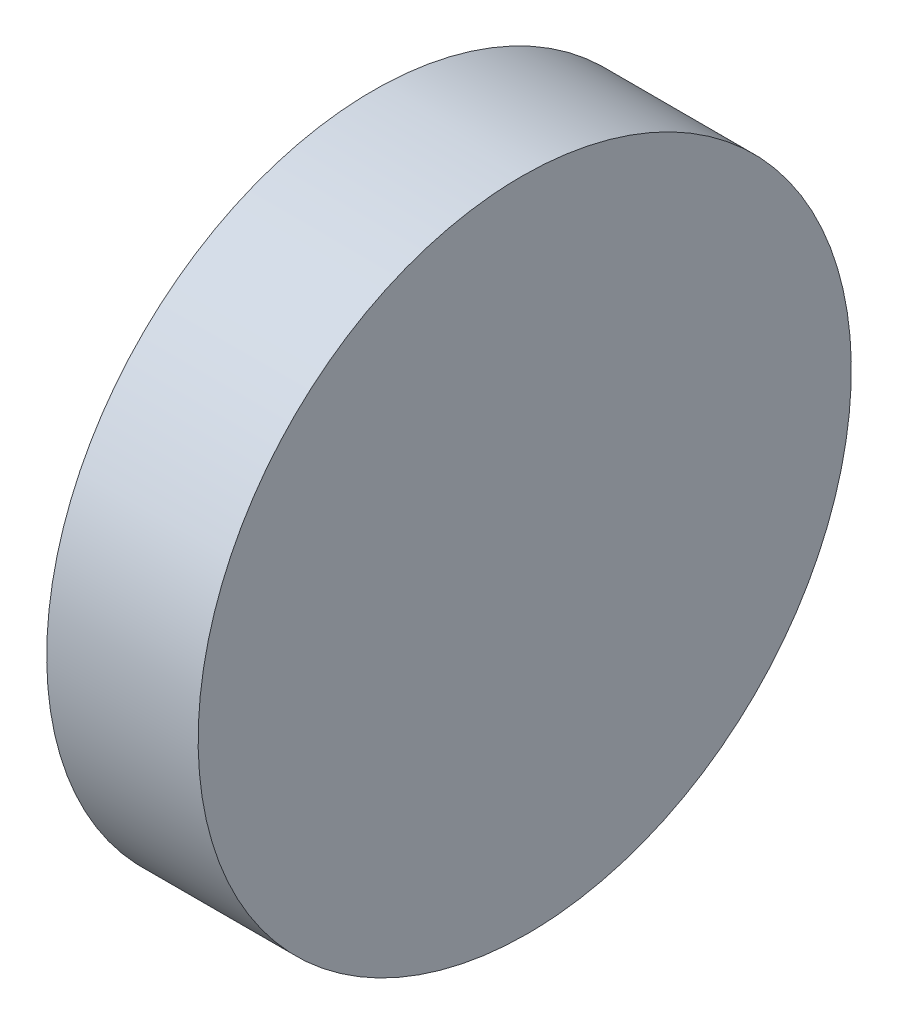
ISO-10303-21;
HEADER;
FILE_DESCRIPTION(('STEP AP214'),'2;1');
FILE_NAME('part.step','',(''),(''),'','','');
FILE_SCHEMA(('AUTOMOTIVE_DESIGN { 1 0 10303 214 1 1 1 1 }'));
ENDSEC;
DATA;
#1=APPLICATION_CONTEXT('core data for automotive mechanical design processes');
#2=APPLICATION_PROTOCOL_DEFINITION('international standard','automotive_design',2000,#1);
#3=PRODUCT_CONTEXT('',#1,'mechanical');
#4=PRODUCT('Part','Part','',(#3));
#5=PRODUCT_RELATED_PRODUCT_CATEGORY('part','',(#4));
#6=PRODUCT_DEFINITION_FORMATION('','',#4);
#7=PRODUCT_DEFINITION_CONTEXT('part definition',#1,'design');
#8=PRODUCT_DEFINITION('design','',#6,#7);
#9=PRODUCT_DEFINITION_SHAPE('','',#8);
#10=(LENGTH_UNIT() NAMED_UNIT(*) SI_UNIT(.MILLI.,.METRE.));
#11=(NAMED_UNIT(*) PLANE_ANGLE_UNIT() SI_UNIT($,.RADIAN.));
#12=(NAMED_UNIT(*) SI_UNIT($,.STERADIAN.) SOLID_ANGLE_UNIT());
#13=UNCERTAINTY_MEASURE_WITH_UNIT(LENGTH_MEASURE(1.E-05),#10,'distance_accuracy_value','');
#14=(GEOMETRIC_REPRESENTATION_CONTEXT(3) GLOBAL_UNCERTAINTY_ASSIGNED_CONTEXT((#13)) GLOBAL_UNIT_ASSIGNED_CONTEXT((#10,
#11,#12)) REPRESENTATION_CONTEXT('',''));
#15=CARTESIAN_POINT('',(0.,0.,0.));
#16=DIRECTION('',(0.,0.,1.));
#17=DIRECTION('',(1.,0.,0.));
#18=AXIS2_PLACEMENT_3D('',#15,#16,#17);
#19=CARTESIAN_POINT('',(0.,6.35,12.7));
#20=DIRECTION('',(1.,0.,0.));
#21=DIRECTION('',(0.,1.,0.));
#22=AXIS2_PLACEMENT_3D('',#19,#20,#21);
#23=PLANE('',#22);
#24=CARTESIAN_POINT('',(0.,0.,6.35));
#25=DIRECTION('',(-1.,0.,0.));
#26=DIRECTION('',(0.,-1.,0.));
#27=AXIS2_PLACEMENT_3D('',#24,#25,#26);
#28=CIRCLE('',#27,6.35);
#29=CARTESIAN_POINT('',(0.,-6.35,6.35));
#30=VERTEX_POINT('',#29);
#31=EDGE_CURVE('E112',#30,#30,#28,.T.);
#32=ORIENTED_EDGE('',*,*,#31,.T.);
#33=EDGE_LOOP('',(#32));
#34=FACE_BOUND('',#33,.T.);
#35=ADVANCED_FACE('F105',(#34),#23,.F.);
#36=CARTESIAN_POINT('',(3.,-6.35,12.7));
#37=DIRECTION('',(-0.999961923064172,-0.008726535498367,0.));
#38=DIRECTION('',(0.008726535498367,-0.999961923064171,0.));
#39=AXIS2_PLACEMENT_3D('',#36,#37,#38);
#40=PLANE('',#39);
#41=CARTESIAN_POINT('',(2.94458438952873,0.,6.35));
#42=DIRECTION('',(-0.999961923064172,-0.008726535498367,0.));
#43=DIRECTION('',(-0.008726535498367,0.999961923064171,0.));
#44=AXIS2_PLACEMENT_3D('',#41,#42,#43);
#45=ELLIPSE('',#44,6.35024179774943,6.35);
#46=CARTESIAN_POINT('',(2.88916877905745,6.35,6.35));
#47=VERTEX_POINT('',#46);
#48=EDGE_CURVE('E11',#47,#47,#45,.T.);
#49=ORIENTED_EDGE('',*,*,#48,.F.);
#50=EDGE_LOOP('',(#49));
#51=FACE_BOUND('',#50,.T.);
#52=ADVANCED_FACE('F107',(#51),#40,.F.);
#53=CARTESIAN_POINT('',(10.,0.,6.35));
#54=DIRECTION('',(-1.,0.,0.));
#55=DIRECTION('',(0.,-1.,0.));
#56=AXIS2_PLACEMENT_3D('',#53,#54,#55);
#57=CYLINDRICAL_SURFACE('',#56,6.35);
#58=ORIENTED_EDGE('',*,*,#31,.F.);
#59=EDGE_LOOP('',(#58));
#60=FACE_BOUND('',#59,.T.);
#61=ORIENTED_EDGE('',*,*,#48,.T.);
#62=EDGE_LOOP('',(#61));
#63=FACE_BOUND('',#62,.T.);
#64=ADVANCED_FACE('F119',(#60,#63),#57,.T.);
#65=CLOSED_SHELL('',(#35,#52,#64));
#66=MANIFOLD_SOLID_BREP('B2',#65);
#67=ADVANCED_BREP_SHAPE_REPRESENTATION('',(#18,#66),#14);
#68=SHAPE_DEFINITION_REPRESENTATION(#9,#67);
ENDSEC;
END-ISO-10303-21;
